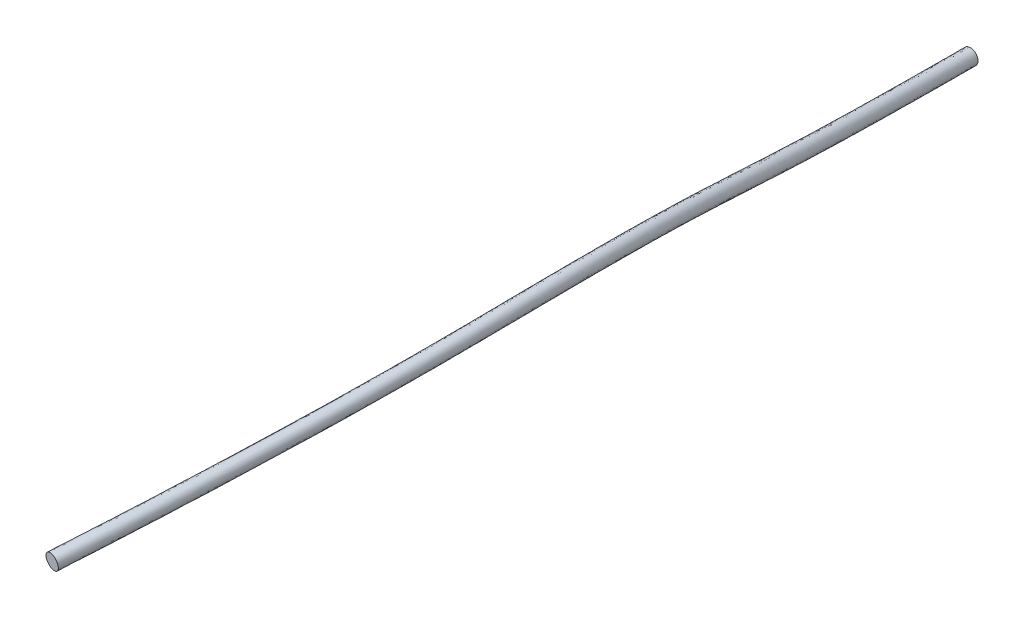
ISO-10303-21;
HEADER;
FILE_DESCRIPTION(('STEP AP214'),'2;1');
FILE_NAME('part.step','',(''),(''),'','','');
FILE_SCHEMA(('AUTOMOTIVE_DESIGN { 1 0 10303 214 1 1 1 1 }'));
ENDSEC;
DATA;
#1=APPLICATION_CONTEXT('core data for automotive mechanical design processes');
#2=APPLICATION_PROTOCOL_DEFINITION('international standard','automotive_design',2000,#1);
#3=PRODUCT_CONTEXT('',#1,'mechanical');
#4=PRODUCT('Part','Part','',(#3));
#5=PRODUCT_RELATED_PRODUCT_CATEGORY('part','',(#4));
#6=PRODUCT_DEFINITION_FORMATION('','',#4);
#7=PRODUCT_DEFINITION_CONTEXT('part definition',#1,'design');
#8=PRODUCT_DEFINITION('design','',#6,#7);
#9=PRODUCT_DEFINITION_SHAPE('','',#8);
#10=(LENGTH_UNIT() NAMED_UNIT(*) SI_UNIT(.MILLI.,.METRE.));
#11=(NAMED_UNIT(*) PLANE_ANGLE_UNIT() SI_UNIT($,.RADIAN.));
#12=(NAMED_UNIT(*) SI_UNIT($,.STERADIAN.) SOLID_ANGLE_UNIT());
#13=UNCERTAINTY_MEASURE_WITH_UNIT(LENGTH_MEASURE(1.E-05),#10,'distance_accuracy_value','');
#14=(GEOMETRIC_REPRESENTATION_CONTEXT(3) GLOBAL_UNCERTAINTY_ASSIGNED_CONTEXT((#13)) GLOBAL_UNIT_ASSIGNED_CONTEXT((#10,
#11,#12)) REPRESENTATION_CONTEXT('',''));
#15=CARTESIAN_POINT('',(0.,0.,0.));
#16=DIRECTION('',(0.,0.,1.));
#17=DIRECTION('',(1.,0.,0.));
#18=AXIS2_PLACEMENT_3D('',#15,#16,#17);
#19=CARTESIAN_POINT('',(0.,0.,0.));
#20=DIRECTION('',(0.,0.,1.));
#21=DIRECTION('',(-1.,0.,0.));
#22=AXIS2_PLACEMENT_3D('',#19,#20,#21);
#23=PLANE('',#22);
#24=CARTESIAN_POINT('',(0.,0.,0.));
#25=DIRECTION('',(0.,0.,-1.));
#26=DIRECTION('',(-1.,0.,0.));
#27=AXIS2_PLACEMENT_3D('',#24,#25,#26);
#28=CIRCLE('',#27,1.15);
#29=CARTESIAN_POINT('',(-1.15,0.,0.));
#30=VERTEX_POINT('',#29);
#31=EDGE_CURVE('E42',#30,#30,#28,.T.);
#32=ORIENTED_EDGE('',*,*,#31,.T.);
#33=EDGE_LOOP('',(#32));
#34=FACE_BOUND('',#33,.T.);
#35=ADVANCED_FACE('F35',(#34),#23,.F.);
#36=CARTESIAN_POINT('',(-4.60653271399671,-1.33060596800163,134.515990322576));
#37=DIRECTION('',(-0.182571577154178,-0.116237277327034,0.976297349466357));
#38=DIRECTION('',(-0.983176639495091,0.0159323463009838,-0.181961138412808));
#39=AXIS2_PLACEMENT_3D('',#36,#37,#38);
#40=PLANE('',#39);
#41=CARTESIAN_POINT('',(-4.60653271399671,-1.33060596800163,134.515990322576));
#42=DIRECTION('',(0.182571577154178,0.116237277327034,-0.976297349466357));
#43=DIRECTION('',(-0.983176639495091,0.0159323463009838,-0.181961138412808));
#44=AXIS2_PLACEMENT_3D('',#41,#42,#43);
#45=CIRCLE('',#44,1.15);
#46=CARTESIAN_POINT('',(-5.73718584941606,-1.3122837697555,134.306735013402));
#47=VERTEX_POINT('',#46);
#48=EDGE_CURVE('E11',#47,#47,#45,.T.);
#49=ORIENTED_EDGE('',*,*,#48,.F.);
#50=EDGE_LOOP('',(#49));
#51=FACE_BOUND('',#50,.T.);
#52=ADVANCED_FACE('F52',(#51),#40,.T.);
#53=CARTESIAN_POINT('',(-1.15,0.,0.));
#54=CARTESIAN_POINT('',(-1.14999999833914,1.55579439842038E-09,2.83630093314077));
#55=CARTESIAN_POINT('',(-0.933948206695335,0.237051398429282,7.05626184927948));
#56=CARTESIAN_POINT('',(-0.347417482113418,0.936245798697613,16.2424860781211));
#57=CARTESIAN_POINT('',(0.0239253150171979,1.39935473012423,21.1987251685674));
#58=CARTESIAN_POINT('',(0.998583203022,2.81458598575012,34.4195047617404));
#59=CARTESIAN_POINT('',(1.40410363583115,3.74194035060327,40.2779025736796));
#60=CARTESIAN_POINT('',(2.52664345136602,5.21452485761242,55.1113554899818));
#61=CARTESIAN_POINT('',(3.07374785295618,5.77181184319701,62.1505387355456));
#62=CARTESIAN_POINT('',(2.90907274382789,5.46185175698496,76.7828756802795));
#63=CARTESIAN_POINT('',(2.34673636886395,4.76362941373253,84.2142405406296));
#64=CARTESIAN_POINT('',(-0.359046508977535,2.40601837754184,104.330890435045));
#65=CARTESIAN_POINT('',(-2.50278767685982,0.746950439838204,117.010864471167));
#66=CARTESIAN_POINT('',(-5.73718584941606,-1.3122837697555,134.306735013402));
#67=CARTESIAN_POINT('',(-1.15,2.3,0.));
#68=CARTESIAN_POINT('',(-1.14999999908105,2.30000000073801,2.70650224178159));
#69=CARTESIAN_POINT('',(-0.937938768916846,2.53259038155263,6.91034432725605));
#70=CARTESIAN_POINT('',(-0.35501783392866,3.22748135923971,16.040028893407));
#71=CARTESIAN_POINT('',(0.0149481698177862,3.6888952656934,20.9784994038727));
#72=CARTESIAN_POINT('',(0.984151458523568,5.09620628298177,34.1252898696915));
#73=CARTESIAN_POINT('',(1.39037475962491,6.02503987411845,39.9939718457644));
#74=CARTESIAN_POINT('',(2.52003408324902,7.50696400315421,54.9215034674772));
#75=CARTESIAN_POINT('',(3.07627844832606,8.07423434529431,62.0605276066185));
#76=CARTESIAN_POINT('',(2.90867539967524,7.75876317454775,76.9530272370219));
#77=CARTESIAN_POINT('',(2.33732480768335,7.05108628107959,84.4552733733445));
#78=CARTESIAN_POINT('',(-0.375181107746148,4.68761798330235,104.621901152489));
#79=CARTESIAN_POINT('',(-2.51802540733216,3.0295588969933,117.29306038126));
#80=CARTESIAN_POINT('',(-5.75005655705727,0.971831692443814,134.576273322788));
#81=CARTESIAN_POINT('',(1.15,2.3,0.));
#82=CARTESIAN_POINT('',(1.15000000020836,2.29999999995582,2.58818089335886));
#83=CARTESIAN_POINT('',(1.35855981316128,2.52866478636888,6.78225002319731));
#84=CARTESIAN_POINT('',(1.93917481989039,3.22080669447188,15.8758192270072));
#85=CARTESIAN_POINT('',(2.30860858364697,3.68146526928123,20.8079957703892));
#86=CARTESIAN_POINT('',(3.27830924497206,5.08949848352443,33.9615328638905));
#87=CARTESIAN_POINT('',(3.68435184162837,6.01798490891256,39.8276528482707));
#88=CARTESIAN_POINT('',(4.81320782401635,7.49885520233565,54.744568966683));
#89=CARTESIAN_POINT('',(5.37751493426225,8.0753189625483,61.9635560965392));
#90=CARTESIAN_POINT('',(5.20731974544957,7.75496874949372,77.0863823901351));
#91=CARTESIAN_POINT('',(4.62562647370413,7.03592018713859,84.6953858269337));
#92=CARTESIAN_POINT('',(1.8959403475369,4.65748314941684,104.989743160071));
#93=CARTESIAN_POINT('',(-0.253152151623996,2.99518548167454,117.692496629187));
#94=CARTESIAN_POINT('',(-3.48875028621856,0.935187295951552,134.994783941137));
#95=CARTESIAN_POINT('',(1.15,0.,0.));
#96=CARTESIAN_POINT('',(1.15000000095027,7.7360610336211E-10,2.71797958471804));
#97=CARTESIAN_POINT('',(1.36255037538279,0.233125803245536,6.92816754522074));
#98=CARTESIAN_POINT('',(1.94677517170564,0.929571133929783,16.0782764117213));
#99=CARTESIAN_POINT('',(2.31758572884638,1.39192473371207,21.0282215350839));
#100=CARTESIAN_POINT('',(3.29274098947049,2.80787818629278,34.2557477559393));
#101=CARTESIAN_POINT('',(3.69808071783263,3.73488538539936,40.1115835761859));
#102=CARTESIAN_POINT('',(4.81981719213461,5.2064160567926,54.9344209891877));
#103=CARTESIAN_POINT('',(5.37498433889237,5.77289646045442,62.0535672254663));
#104=CARTESIAN_POINT('',(5.20771708960221,5.45805733192795,76.9162308333927));
#105=CARTESIAN_POINT('',(4.63503803488363,4.74846331978931,84.4543529942188));
#106=CARTESIAN_POINT('',(1.91207494630663,2.37588354365856,104.698732442627));
#107=CARTESIAN_POINT('',(-0.237914421163183,0.712577024519449,117.410300719093));
#108=CARTESIAN_POINT('',(-3.47587957857735,-1.34892816624776,134.725245631751));
#109=CARTESIAN_POINT('',(1.15,-2.3,0.));
#110=CARTESIAN_POINT('',(1.15000000169217,-2.29999999840861,2.84777827607722));
#111=CARTESIAN_POINT('',(1.3665409376043,-2.06241317987781,7.07408506724417));
#112=CARTESIAN_POINT('',(1.95437552352088,-1.36166442661231,16.2807335964354));
#113=CARTESIAN_POINT('',(2.32656287404579,-0.897615801857099,21.2484472997787));
#114=CARTESIAN_POINT('',(3.30717273396892,0.526257889061131,34.5499626479881));
#115=CARTESIAN_POINT('',(3.71180959403689,1.45178586188616,40.3955143041011));
#116=CARTESIAN_POINT('',(4.82642656025288,2.91397691124956,55.1242730116923));
#117=CARTESIAN_POINT('',(5.3724537435225,3.47047395836053,62.1435783543933));
#118=CARTESIAN_POINT('',(5.20811443375485,3.16114591436218,76.7460792766503));
#119=CARTESIAN_POINT('',(4.64444959606312,2.46100645244002,84.213320161504));
#120=CARTESIAN_POINT('',(1.92820954507635,0.0942839379002736,104.407721725183));
#121=CARTESIAN_POINT('',(-0.222676690702368,-1.57003143263564,117.128104809));
#122=CARTESIAN_POINT('',(-3.46300887093615,-3.63304362844708,134.455707322365));
#123=CARTESIAN_POINT('',(-1.15,-2.3,0.));
#124=CARTESIAN_POINT('',(-1.14999999759724,-2.29999999762642,2.96609962449996));
#125=CARTESIAN_POINT('',(-0.929957644473825,-2.05848758469407,7.20217937130291));
#126=CARTESIAN_POINT('',(-0.339817130298175,-1.35498976184448,16.4449432628351));
#127=CARTESIAN_POINT('',(0.0329024602166094,-0.890185805444934,21.4189509332622));
#128=CARTESIAN_POINT('',(1.01301494752043,0.532965688518477,34.7137196537892));
#129=CARTESIAN_POINT('',(1.41783251203739,1.45884082708809,40.5618333015948));
#130=CARTESIAN_POINT('',(2.53325281948302,2.92208571207064,55.3012075124864));
#131=CARTESIAN_POINT('',(3.07121725758631,3.46938934109971,62.2405498644726));
#132=CARTESIAN_POINT('',(2.90947008798053,3.16494033942218,76.6127241235371));
#133=CARTESIAN_POINT('',(2.35614793004456,2.47617254638547,83.9732077079148));
#134=CARTESIAN_POINT('',(-0.342911910208922,0.124418771781334,104.039879717601));
#135=CARTESIAN_POINT('',(-2.48754994638747,-1.53565801731689,116.728668561074));
#136=CARTESIAN_POINT('',(-5.72431514177486,-3.59639923195482,134.037196704015));
#137=CARTESIAN_POINT('',(-1.15,0.,0.));
#138=CARTESIAN_POINT('',(-1.14999999833914,1.55579439842038E-09,2.83630093314077));
#139=CARTESIAN_POINT('',(-0.933948206695335,0.237051398429282,7.05626184927948));
#140=CARTESIAN_POINT('',(-0.347417482113418,0.936245798697613,16.2424860781211));
#141=CARTESIAN_POINT('',(0.0239253150171979,1.39935473012423,21.1987251685674));
#142=CARTESIAN_POINT('',(0.998583203022,2.81458598575012,34.4195047617404));
#143=CARTESIAN_POINT('',(1.40410363583115,3.74194035060327,40.2779025736796));
#144=CARTESIAN_POINT('',(2.52664345136602,5.21452485761242,55.1113554899818));
#145=CARTESIAN_POINT('',(3.07374785295618,5.77181184319701,62.1505387355456));
#146=CARTESIAN_POINT('',(2.90907274382789,5.46185175698496,76.7828756802795));
#147=CARTESIAN_POINT('',(2.34673636886395,4.76362941373253,84.2142405406296));
#148=CARTESIAN_POINT('',(-0.359046508977535,2.40601837754184,104.330890435045));
#149=CARTESIAN_POINT('',(-2.50278767685982,0.746950439838204,117.010864471167));
#150=CARTESIAN_POINT('',(-5.73718584941606,-1.3122837697555,134.306735013402));
#151=(BOUNDED_SURFACE() B_SPLINE_SURFACE(3,3,((#53,#54,#55,#56,#57,#58,#59,#60,#61,#62,#63,#64,
#65,#66),(#67,#68,#69,#70,#71,#72,#73,#74,#75,#76,#77,#78,#79,#80),(#81,#82,#83,#84,#85,#86,#87,
#88,#89,#90,#91,#92,#93,#94),(#95,#96,#97,#98,#99,#100,#101,#102,#103,#104,#105,#106,#107,#108),
(#109,#110,#111,#112,#113,#114,#115,#116,#117,#118,#119,#120,#121,#122),(#123,#124,#125,#126,
#127,#128,#129,#130,#131,#132,#133,#134,#135,#136),(#137,#138,#139,#140,#141,#142,#143,#144,
#145,#146,#147,#148,#149,#150)),.UNSPECIFIED.,.T.,.F.,.F.) B_SPLINE_SURFACE_WITH_KNOTS((4,3,4),
(4,2,2,2,2,2,4),(0.,0.5,1.),(0.,0.127992355602088,0.255984711204176,0.525951587681623,
0.698297396141514,0.849148698070757,1.),
.UNSPECIFIED.) GEOMETRIC_REPRESENTATION_ITEM() RATIONAL_B_SPLINE_SURFACE(((1.,1.,1.,1.,1.,1.,1.,
1.,1.,1.,1.,1.,1.,1.),(0.333333333333333,0.333333333333333,0.333333333333333,0.333333333333333,
0.333333333333333,0.333333333333333,0.333333333333333,0.333333333333333,0.333333333333333,
0.333333333333333,0.333333333333333,0.333333333333333,0.333333333333333,0.333333333333333),
(0.333333333333333,0.333333333333333,0.333333333333333,0.333333333333333,0.333333333333333,
0.333333333333333,0.333333333333333,0.333333333333333,0.333333333333333,0.333333333333333,
0.333333333333333,0.333333333333333,0.333333333333333,0.333333333333333),(1.,1.,1.,1.,1.,1.,1.,
1.,1.,1.,1.,1.,1.,1.),(0.333333333333333,0.333333333333333,0.333333333333333,0.333333333333333,
0.333333333333333,0.333333333333333,0.333333333333333,0.333333333333333,0.333333333333333,
0.333333333333333,0.333333333333333,0.333333333333333,0.333333333333333,0.333333333333333),
(0.333333333333333,0.333333333333333,0.333333333333333,0.333333333333333,0.333333333333333,
0.333333333333333,0.333333333333333,0.333333333333333,0.333333333333333,0.333333333333333,
0.333333333333333,0.333333333333333,0.333333333333333,0.333333333333333),(1.,1.,1.,1.,1.,1.,1.,
1.,1.,1.,1.,1.,1.,1.))) REPRESENTATION_ITEM('') SURFACE());
#152=ORIENTED_EDGE('',*,*,#48,.T.);
#153=EDGE_LOOP('',(#152));
#154=FACE_BOUND('',#153,.T.);
#155=ORIENTED_EDGE('',*,*,#31,.F.);
#156=EDGE_LOOP('',(#155));
#157=FACE_BOUND('',#156,.T.);
#158=ADVANCED_FACE('F49',(#154,#157),#151,.F.);
#159=CLOSED_SHELL('',(#35,#52,#158));
#160=MANIFOLD_SOLID_BREP('B2',#159);
#161=ADVANCED_BREP_SHAPE_REPRESENTATION('',(#18,#160),#14);
#162=SHAPE_DEFINITION_REPRESENTATION(#9,#161);
ENDSEC;
END-ISO-10303-21;
